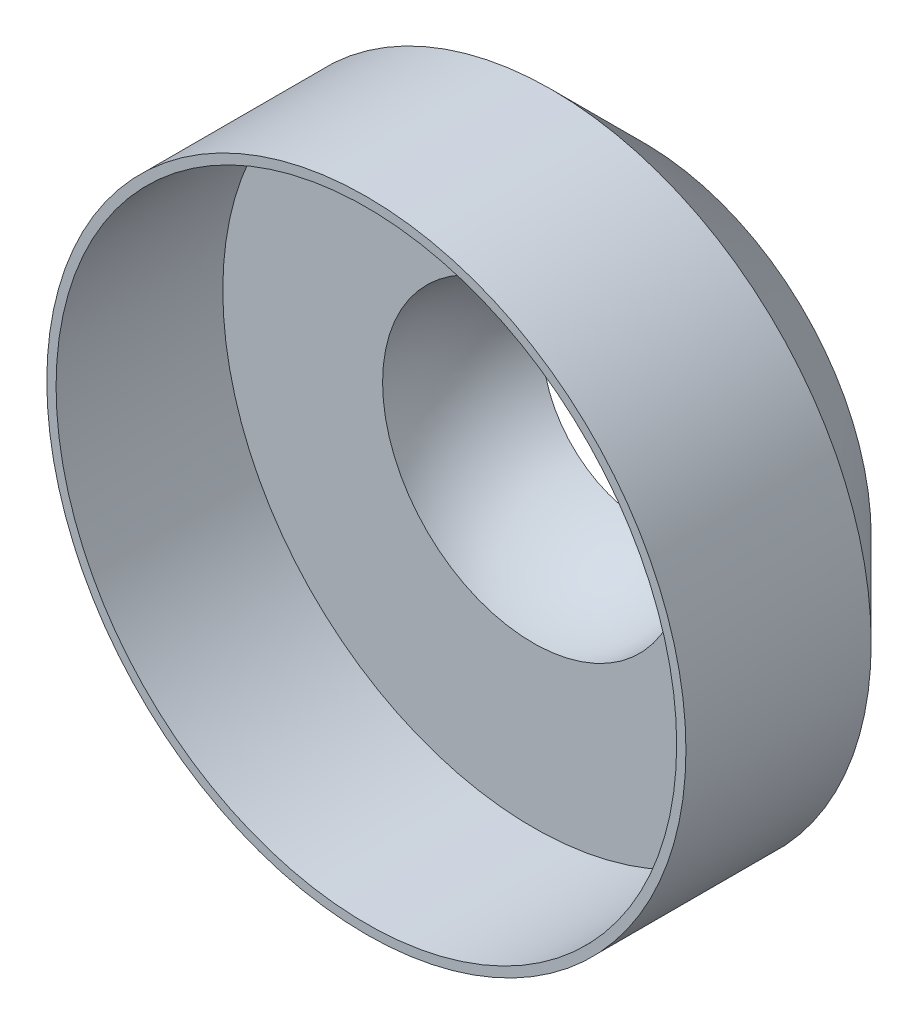
ISO-10303-21;
HEADER;
FILE_DESCRIPTION(('STEP AP214'),'2;1');
FILE_NAME('part.step','',(''),(''),'','','');
FILE_SCHEMA(('AUTOMOTIVE_DESIGN { 1 0 10303 214 1 1 1 1 }'));
ENDSEC;
DATA;
#1=APPLICATION_CONTEXT('core data for automotive mechanical design processes');
#2=APPLICATION_PROTOCOL_DEFINITION('international standard','automotive_design',2000,#1);
#3=PRODUCT_CONTEXT('',#1,'mechanical');
#4=PRODUCT('Part','Part','',(#3));
#5=PRODUCT_RELATED_PRODUCT_CATEGORY('part','',(#4));
#6=PRODUCT_DEFINITION_FORMATION('','',#4);
#7=PRODUCT_DEFINITION_CONTEXT('part definition',#1,'design');
#8=PRODUCT_DEFINITION('design','',#6,#7);
#9=PRODUCT_DEFINITION_SHAPE('','',#8);
#10=(LENGTH_UNIT() NAMED_UNIT(*) SI_UNIT(.MILLI.,.METRE.));
#11=(NAMED_UNIT(*) PLANE_ANGLE_UNIT() SI_UNIT($,.RADIAN.));
#12=(NAMED_UNIT(*) SI_UNIT($,.STERADIAN.) SOLID_ANGLE_UNIT());
#13=UNCERTAINTY_MEASURE_WITH_UNIT(LENGTH_MEASURE(1.E-05),#10,'distance_accuracy_value','');
#14=(GEOMETRIC_REPRESENTATION_CONTEXT(3) GLOBAL_UNCERTAINTY_ASSIGNED_CONTEXT((#13)) GLOBAL_UNIT_ASSIGNED_CONTEXT((#10,
#11,#12)) REPRESENTATION_CONTEXT('',''));
#15=CARTESIAN_POINT('',(0.,0.,0.));
#16=DIRECTION('',(0.,0.,1.));
#17=DIRECTION('',(1.,0.,0.));
#18=AXIS2_PLACEMENT_3D('',#15,#16,#17);
#19=CARTESIAN_POINT('',(0.,0.,30.));
#20=DIRECTION('',(0.,0.,-1.));
#21=DIRECTION('',(-1.,0.,0.));
#22=AXIS2_PLACEMENT_3D('',#19,#20,#21);
#23=CYLINDRICAL_SURFACE('',#22,34.5);
#24=CARTESIAN_POINT('',(0.,0.,10.));
#25=DIRECTION('',(0.,0.,1.));
#26=DIRECTION('',(1.,0.,0.));
#27=AXIS2_PLACEMENT_3D('',#24,#25,#26);
#28=CIRCLE('',#27,34.5);
#29=CARTESIAN_POINT('',(34.5,0.,10.));
#30=VERTEX_POINT('',#29);
#31=EDGE_CURVE('E43',#30,#30,#28,.T.);
#32=ORIENTED_EDGE('',*,*,#31,.T.);
#33=EDGE_LOOP('',(#32));
#34=FACE_BOUND('',#33,.T.);
#35=CARTESIAN_POINT('',(0.,0.,30.));
#36=DIRECTION('',(0.,0.,1.));
#37=DIRECTION('',(1.,0.,0.));
#38=AXIS2_PLACEMENT_3D('',#35,#36,#37);
#39=CIRCLE('',#38,34.5);
#40=CARTESIAN_POINT('',(34.5,0.,30.));
#41=VERTEX_POINT('',#40);
#42=EDGE_CURVE('E47',#41,#41,#39,.T.);
#43=ORIENTED_EDGE('',*,*,#42,.F.);
#44=EDGE_LOOP('',(#43));
#45=FACE_BOUND('',#44,.T.);
#46=ADVANCED_FACE('F35',(#34,#45),#23,.T.);
#47=CARTESIAN_POINT('',(0.,0.,30.));
#48=DIRECTION('',(0.,0.,1.));
#49=DIRECTION('',(1.,0.,0.));
#50=AXIS2_PLACEMENT_3D('',#47,#48,#49);
#51=PLANE('',#50);
#52=CARTESIAN_POINT('',(0.,0.,30.));
#53=DIRECTION('',(0.,0.,1.));
#54=DIRECTION('',(1.,0.,0.));
#55=AXIS2_PLACEMENT_3D('',#52,#53,#54);
#56=CIRCLE('',#55,33.5);
#57=CARTESIAN_POINT('',(33.5,0.,30.));
#58=VERTEX_POINT('',#57);
#59=EDGE_CURVE('E54',#58,#58,#56,.T.);
#60=ORIENTED_EDGE('',*,*,#59,.F.);
#61=EDGE_LOOP('',(#60));
#62=FACE_BOUND('',#61,.T.);
#63=ORIENTED_EDGE('',*,*,#42,.T.);
#64=EDGE_LOOP('',(#63));
#65=FACE_BOUND('',#64,.T.);
#66=ADVANCED_FACE('F78',(#62,#65),#51,.T.);
#67=CARTESIAN_POINT('',(0.,0.,0.));
#68=DIRECTION('',(0.,0.,1.));
#69=DIRECTION('',(1.,0.,0.));
#70=AXIS2_PLACEMENT_3D('',#67,#68,#69);
#71=PLANE('',#70);
#72=CARTESIAN_POINT('',(0.,0.,0.));
#73=DIRECTION('',(0.,0.,1.));
#74=DIRECTION('',(1.,0.,0.));
#75=AXIS2_PLACEMENT_3D('',#72,#73,#74);
#76=CIRCLE('',#75,24.5);
#77=CARTESIAN_POINT('',(24.5,0.,0.));
#78=VERTEX_POINT('',#77);
#79=EDGE_CURVE('E10',#78,#78,#76,.F.);
#80=ORIENTED_EDGE('',*,*,#79,.T.);
#81=EDGE_LOOP('',(#80));
#82=FACE_BOUND('',#81,.T.);
#83=CARTESIAN_POINT('',(0.,0.,0.));
#84=DIRECTION('',(0.,0.,1.));
#85=DIRECTION('',(1.,0.,0.));
#86=AXIS2_PLACEMENT_3D('',#83,#84,#85);
#87=CIRCLE('',#86,10.9573035004056);
#88=CARTESIAN_POINT('',(10.9573035004056,0.,0.));
#89=VERTEX_POINT('',#88);
#90=EDGE_CURVE('E57',#89,#89,#87,.T.);
#91=ORIENTED_EDGE('',*,*,#90,.T.);
#92=EDGE_LOOP('',(#91));
#93=FACE_BOUND('',#92,.T.);
#94=ADVANCED_FACE('F75',(#82,#93),#71,.F.);
#95=CARTESIAN_POINT('',(0.,0.,12.));
#96=DIRECTION('',(0.,0.,1.));
#97=DIRECTION('',(1.,0.,0.));
#98=AXIS2_PLACEMENT_3D('',#95,#96,#97);
#99=CYLINDRICAL_SURFACE('',#98,33.5);
#100=CARTESIAN_POINT('',(0.,0.,12.));
#101=DIRECTION('',(0.,0.,1.));
#102=DIRECTION('',(1.,0.,0.));
#103=AXIS2_PLACEMENT_3D('',#100,#101,#102);
#104=CIRCLE('',#103,33.5);
#105=CARTESIAN_POINT('',(33.5,0.,12.));
#106=VERTEX_POINT('',#105);
#107=EDGE_CURVE('E51',#106,#106,#104,.T.);
#108=ORIENTED_EDGE('',*,*,#107,.F.);
#109=EDGE_LOOP('',(#108));
#110=FACE_BOUND('',#109,.T.);
#111=ORIENTED_EDGE('',*,*,#59,.T.);
#112=EDGE_LOOP('',(#111));
#113=FACE_BOUND('',#112,.T.);
#114=ADVANCED_FACE('F77',(#110,#113),#99,.F.);
#115=CARTESIAN_POINT('',(0.,0.,12.));
#116=DIRECTION('',(0.,0.,1.));
#117=DIRECTION('',(1.,0.,0.));
#118=AXIS2_PLACEMENT_3D('',#115,#116,#117);
#119=PLANE('',#118);
#120=CARTESIAN_POINT('',(0.,0.,12.));
#121=DIRECTION('',(0.,0.,-1.));
#122=DIRECTION('',(-1.,0.,0.));
#123=AXIS2_PLACEMENT_3D('',#120,#121,#122);
#124=CIRCLE('',#123,16.25);
#125=CARTESIAN_POINT('',(-16.25,0.,12.));
#126=VERTEX_POINT('',#125);
#127=EDGE_CURVE('E62',#126,#126,#124,.T.);
#128=ORIENTED_EDGE('',*,*,#127,.T.);
#129=EDGE_LOOP('',(#128));
#130=FACE_BOUND('',#129,.T.);
#131=ORIENTED_EDGE('',*,*,#107,.T.);
#132=EDGE_LOOP('',(#131));
#133=FACE_BOUND('',#132,.T.);
#134=ADVANCED_FACE('F66',(#130,#133),#119,.T.);
#135=CARTESIAN_POINT('',(0.,0.,12.));
#136=DIRECTION('',(1.,0.,0.));
#137=DIRECTION('',(0.,-1.,0.));
#138=AXIS2_PLACEMENT_3D('',#135,#136,#137);
#139=SPHERICAL_SURFACE('',#138,16.25);
#140=CARTESIAN_POINT('',(0.,0.,12.));
#141=DIRECTION('',(0.,0.,-1.));
#142=DIRECTION('',(-1.,0.,0.));
#143=AXIS2_PLACEMENT_3D('',#140,#141,#142);
#144=SPHERICAL_SURFACE('',#143,16.25);
#145=ORIENTED_EDGE('',*,*,#127,.F.);
#146=EDGE_LOOP('',(#145));
#147=FACE_BOUND('',#146,.T.);
#148=ORIENTED_EDGE('',*,*,#90,.F.);
#149=EDGE_LOOP('',(#148));
#150=FACE_BOUND('',#149,.T.);
#151=ADVANCED_FACE('F69',(#147,#150),#144,.F.);
#152=CARTESIAN_POINT('',(0.,0.,10.));
#153=DIRECTION('',(0.,0.,1.));
#154=DIRECTION('',(1.,0.,0.));
#155=AXIS2_PLACEMENT_3D('',#152,#153,#154);
#156=CONICAL_SURFACE('',#155,34.5,0.78539816339745);
#157=ORIENTED_EDGE('',*,*,#79,.F.);
#158=EDGE_LOOP('',(#157));
#159=FACE_BOUND('',#158,.T.);
#160=ORIENTED_EDGE('',*,*,#31,.F.);
#161=EDGE_LOOP('',(#160));
#162=FACE_BOUND('',#161,.T.);
#163=ADVANCED_FACE('F38',(#159,#162),#156,.T.);
#164=CLOSED_SHELL('',(#46,#66,#94,#114,#134,#151,#163));
#165=MANIFOLD_SOLID_BREP('B2',#164);
#166=ADVANCED_BREP_SHAPE_REPRESENTATION('',(#18,#165),#14);
#167=SHAPE_DEFINITION_REPRESENTATION(#9,#166);
ENDSEC;
END-ISO-10303-21;
